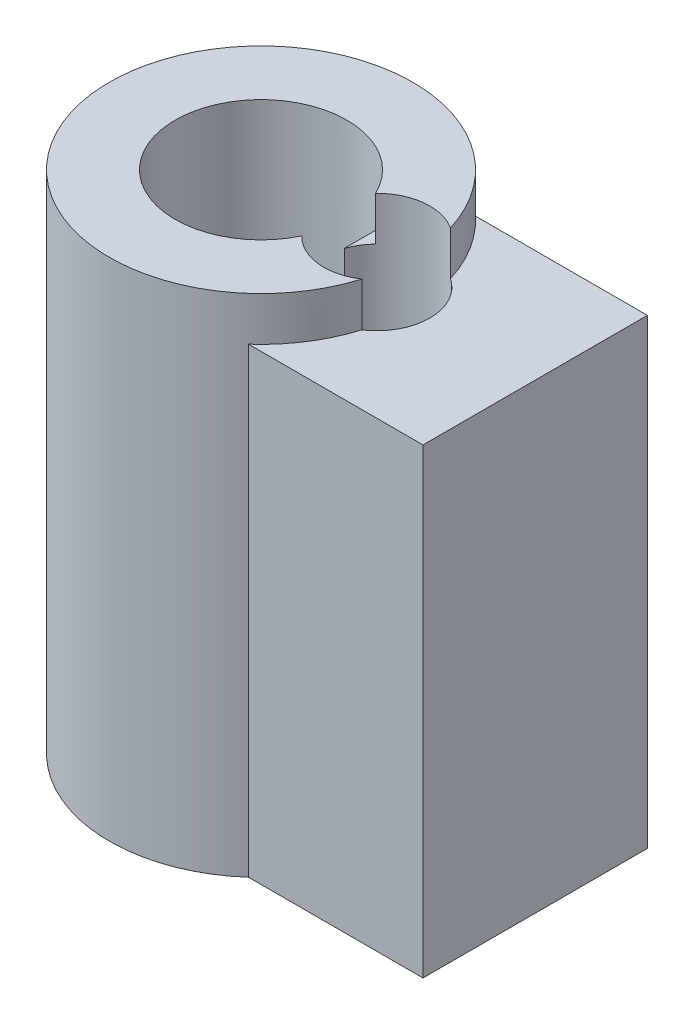
ISO-10303-21;
HEADER;
FILE_DESCRIPTION(('STEP AP214'),'2;1');
FILE_NAME('part.step','',(''),(''),'','','');
FILE_SCHEMA(('AUTOMOTIVE_DESIGN { 1 0 10303 214 1 1 1 1 }'));
ENDSEC;
DATA;
#1=APPLICATION_CONTEXT('core data for automotive mechanical design processes');
#2=APPLICATION_PROTOCOL_DEFINITION('international standard','automotive_design',2000,#1);
#3=PRODUCT_CONTEXT('',#1,'mechanical');
#4=PRODUCT('Part','Part','',(#3));
#5=PRODUCT_RELATED_PRODUCT_CATEGORY('part','',(#4));
#6=PRODUCT_DEFINITION_FORMATION('','',#4);
#7=PRODUCT_DEFINITION_CONTEXT('part definition',#1,'design');
#8=PRODUCT_DEFINITION('design','',#6,#7);
#9=PRODUCT_DEFINITION_SHAPE('','',#8);
#10=(LENGTH_UNIT() NAMED_UNIT(*) SI_UNIT(.MILLI.,.METRE.));
#11=(NAMED_UNIT(*) PLANE_ANGLE_UNIT() SI_UNIT($,.RADIAN.));
#12=(NAMED_UNIT(*) SI_UNIT($,.STERADIAN.) SOLID_ANGLE_UNIT());
#13=UNCERTAINTY_MEASURE_WITH_UNIT(LENGTH_MEASURE(1.E-05),#10,'distance_accuracy_value','');
#14=(GEOMETRIC_REPRESENTATION_CONTEXT(3) GLOBAL_UNCERTAINTY_ASSIGNED_CONTEXT((#13)) GLOBAL_UNIT_ASSIGNED_CONTEXT((#10,
#11,#12)) REPRESENTATION_CONTEXT('',''));
#15=CARTESIAN_POINT('',(0.,0.,0.));
#16=DIRECTION('',(0.,0.,1.));
#17=DIRECTION('',(1.,0.,0.));
#18=AXIS2_PLACEMENT_3D('',#15,#16,#17);
#19=CARTESIAN_POINT('',(0.,20.,0.));
#20=DIRECTION('',(0.,-1.,0.));
#21=DIRECTION('',(0.,0.,-1.));
#22=AXIS2_PLACEMENT_3D('',#19,#20,#21);
#23=CYLINDRICAL_SURFACE('',#22,6.);
#24=DIRECTION('',(0.,-1.,0.));
#25=VECTOR('',#24,1.);
#26=CARTESIAN_POINT('',(5.7385577507969,18.26,1.75184329800608));
#27=LINE('',#26,#25);
#28=CARTESIAN_POINT('',(5.7385577507969,20.,1.75184329800608));
#29=VERTEX_POINT('',#28);
#30=CARTESIAN_POINT('',(5.7385577507969,18.26,1.75184329800608));
#31=VERTEX_POINT('',#30);
#32=EDGE_CURVE('E46',#29,#31,#27,.T.);
#33=ORIENTED_EDGE('',*,*,#32,.F.);
#34=CARTESIAN_POINT('',(0.,20.,0.));
#35=DIRECTION('',(0.,1.,0.));
#36=DIRECTION('',(0.,0.,1.));
#37=AXIS2_PLACEMENT_3D('',#34,#35,#36);
#38=CIRCLE('',#37,6.);
#39=CARTESIAN_POINT('',(5.7385577507969,20.,-1.75184329800608));
#40=VERTEX_POINT('',#39);
#41=EDGE_CURVE('E129',#40,#29,#38,.T.);
#42=ORIENTED_EDGE('',*,*,#41,.F.);
#43=DIRECTION('',(0.,-1.,0.));
#44=VECTOR('',#43,1.);
#45=CARTESIAN_POINT('',(5.7385577507969,18.26,-1.75184329800608));
#46=LINE('',#45,#44);
#47=CARTESIAN_POINT('',(5.7385577507969,18.26,-1.75184329800608));
#48=VERTEX_POINT('',#47);
#49=EDGE_CURVE('E120',#48,#40,#46,.F.);
#50=ORIENTED_EDGE('',*,*,#49,.F.);
#51=CARTESIAN_POINT('',(0.,18.26,0.));
#52=DIRECTION('',(0.,-1.,0.));
#53=DIRECTION('',(0.,0.,-1.));
#54=AXIS2_PLACEMENT_3D('',#51,#52,#53);
#55=CIRCLE('',#54,6.);
#56=CARTESIAN_POINT('',(4.08541489606759,18.26,-4.39424454565163));
#57=VERTEX_POINT('',#56);
#58=EDGE_CURVE('E126',#57,#48,#55,.T.);
#59=ORIENTED_EDGE('',*,*,#58,.F.);
#60=DIRECTION('',(0.,-1.,0.));
#61=VECTOR('',#60,1.);
#62=CARTESIAN_POINT('',(4.08541489606759,20.,-4.39424454565163));
#63=LINE('',#62,#61);
#64=CARTESIAN_POINT('',(4.08541489606759,0.,-4.39424454565163));
#65=VERTEX_POINT('',#64);
#66=EDGE_CURVE('E138',#57,#65,#63,.T.);
#67=ORIENTED_EDGE('',*,*,#66,.T.);
#68=CARTESIAN_POINT('',(0.,0.,0.));
#69=DIRECTION('',(0.,1.,0.));
#70=DIRECTION('',(0.,0.,1.));
#71=AXIS2_PLACEMENT_3D('',#68,#69,#70);
#72=CIRCLE('',#71,6.);
#73=CARTESIAN_POINT('',(3.98914735179202,0.,4.48181920716251));
#74=VERTEX_POINT('',#73);
#75=EDGE_CURVE('E149',#65,#74,#72,.T.);
#76=ORIENTED_EDGE('',*,*,#75,.T.);
#77=DIRECTION('',(0.,-1.,0.));
#78=VECTOR('',#77,1.);
#79=CARTESIAN_POINT('',(3.98914735179202,20.,4.48181920716251));
#80=LINE('',#79,#78);
#81=CARTESIAN_POINT('',(3.98914735179202,18.26,4.48181920716251));
#82=VERTEX_POINT('',#81);
#83=EDGE_CURVE('E136',#74,#82,#80,.F.);
#84=ORIENTED_EDGE('',*,*,#83,.T.);
#85=EDGE_CURVE('E53',#31,#82,#55,.T.);
#86=ORIENTED_EDGE('',*,*,#85,.F.);
#87=EDGE_LOOP('',(#33,#42,#50,#59,#67,#76,#84,#86));
#88=FACE_BOUND('',#87,.T.);
#89=ADVANCED_FACE('F33',(#88),#23,.T.);
#90=CARTESIAN_POINT('',(0.,6.45,0.));
#91=DIRECTION('',(0.,1.,0.));
#92=DIRECTION('',(0.,0.,1.));
#93=AXIS2_PLACEMENT_3D('',#90,#91,#92);
#94=CYLINDRICAL_SURFACE('',#93,3.4);
#95=DIRECTION('',(0.,-1.,0.));
#96=VECTOR('',#95,1.);
#97=CARTESIAN_POINT('',(3.07073997921671,18.26,-1.45964241512782));
#98=LINE('',#97,#96);
#99=CARTESIAN_POINT('',(3.07073997921671,20.,-1.45964241512782));
#100=VERTEX_POINT('',#99);
#101=CARTESIAN_POINT('',(3.07073997921671,18.26,-1.45964241512782));
#102=VERTEX_POINT('',#101);
#103=EDGE_CURVE('E219',#100,#102,#98,.T.);
#104=ORIENTED_EDGE('',*,*,#103,.F.);
#105=CARTESIAN_POINT('',(0.,20.,0.));
#106=DIRECTION('',(0.,1.,0.));
#107=DIRECTION('',(0.,0.,1.));
#108=AXIS2_PLACEMENT_3D('',#105,#106,#107);
#109=CIRCLE('',#108,3.4);
#110=CARTESIAN_POINT('',(3.07073997921671,20.,1.45964241512782));
#111=VERTEX_POINT('',#110);
#112=EDGE_CURVE('E145',#100,#111,#109,.T.);
#113=ORIENTED_EDGE('',*,*,#112,.T.);
#114=DIRECTION('',(0.,-1.,0.));
#115=VECTOR('',#114,1.);
#116=CARTESIAN_POINT('',(3.07073997921671,18.26,1.45964241512782));
#117=LINE('',#116,#115);
#118=CARTESIAN_POINT('',(3.07073997921671,18.26,1.45964241512782));
#119=VERTEX_POINT('',#118);
#120=EDGE_CURVE('E221',#119,#111,#117,.F.);
#121=ORIENTED_EDGE('',*,*,#120,.F.);
#122=CARTESIAN_POINT('',(0.,18.26,0.));
#123=DIRECTION('',(0.,-1.,0.));
#124=DIRECTION('',(0.,0.,-1.));
#125=AXIS2_PLACEMENT_3D('',#122,#123,#124);
#126=CIRCLE('',#125,3.4);
#127=CARTESIAN_POINT('',(2.6,18.26,2.19089023002066));
#128=VERTEX_POINT('',#127);
#129=EDGE_CURVE('E40',#128,#119,#126,.F.);
#130=ORIENTED_EDGE('',*,*,#129,.F.);
#131=DIRECTION('',(0.,1.,0.));
#132=VECTOR('',#131,1.);
#133=CARTESIAN_POINT('',(2.6,6.45,2.19089023002066));
#134=LINE('',#133,#132);
#135=CARTESIAN_POINT('',(2.6,6.45,2.19089023002066));
#136=VERTEX_POINT('',#135);
#137=EDGE_CURVE('E140',#128,#136,#134,.F.);
#138=ORIENTED_EDGE('',*,*,#137,.T.);
#139=CARTESIAN_POINT('',(0.,6.45,0.));
#140=DIRECTION('',(0.,1.,0.));
#141=DIRECTION('',(0.,0.,1.));
#142=AXIS2_PLACEMENT_3D('',#139,#140,#141);
#143=CIRCLE('',#142,3.4);
#144=CARTESIAN_POINT('',(2.6,6.45,-2.19089023002066));
#145=VERTEX_POINT('',#144);
#146=EDGE_CURVE('E146',#145,#136,#143,.T.);
#147=ORIENTED_EDGE('',*,*,#146,.F.);
#148=DIRECTION('',(0.,1.,0.));
#149=VECTOR('',#148,1.);
#150=CARTESIAN_POINT('',(2.6,6.45,-2.19089023002066));
#151=LINE('',#150,#149);
#152=CARTESIAN_POINT('',(2.6,18.26,-2.19089023002066));
#153=VERTEX_POINT('',#152);
#154=EDGE_CURVE('E175',#145,#153,#151,.T.);
#155=ORIENTED_EDGE('',*,*,#154,.T.);
#156=EDGE_CURVE('E157',#102,#153,#126,.F.);
#157=ORIENTED_EDGE('',*,*,#156,.F.);
#158=EDGE_LOOP('',(#104,#113,#121,#130,#138,#147,#155,#157));
#159=FACE_BOUND('',#158,.T.);
#160=ADVANCED_FACE('F176',(#159),#94,.F.);
#161=CARTESIAN_POINT('',(2.6,-12.1438727434811,4.48181920716251));
#162=DIRECTION('',(-1.,0.,0.));
#163=DIRECTION('',(0.,0.,1.));
#164=AXIS2_PLACEMENT_3D('',#161,#162,#163);
#165=PLANE('',#164);
#166=DIRECTION('',(0.,0.,1.));
#167=VECTOR('',#166,1.);
#168=CARTESIAN_POINT('',(2.6,6.45,0.));
#169=LINE('',#168,#167);
#170=CARTESIAN_POINT('',(2.6,6.45,-0.698233220468591));
#171=VERTEX_POINT('',#170);
#172=EDGE_CURVE('E155',#145,#171,#169,.T.);
#173=ORIENTED_EDGE('',*,*,#172,.T.);
#174=DIRECTION('',(0.,-1.,0.));
#175=VECTOR('',#174,1.);
#176=CARTESIAN_POINT('',(2.6,48.26,-0.698233220468591));
#177=LINE('',#176,#175);
#178=CARTESIAN_POINT('',(2.6,18.26,-0.698233220468591));
#179=VERTEX_POINT('',#178);
#180=EDGE_CURVE('E182',#171,#179,#177,.F.);
#181=ORIENTED_EDGE('',*,*,#180,.T.);
#182=DIRECTION('',(0.,0.,1.));
#183=VECTOR('',#182,1.);
#184=CARTESIAN_POINT('',(2.6,18.26,4.48181920716251));
#185=LINE('',#184,#183);
#186=EDGE_CURVE('E169',#153,#179,#185,.T.);
#187=ORIENTED_EDGE('',*,*,#186,.F.);
#188=ORIENTED_EDGE('',*,*,#154,.F.);
#189=EDGE_LOOP('',(#173,#181,#187,#188));
#190=FACE_BOUND('',#189,.T.);
#191=ADVANCED_FACE('F181',(#190),#165,.T.);
#192=CARTESIAN_POINT('',(2.6,18.26,0.698233220468591));
#193=VERTEX_POINT('',#192);
#194=EDGE_CURVE('E184',#193,#128,#185,.T.);
#195=ORIENTED_EDGE('',*,*,#194,.F.);
#196=DIRECTION('',(0.,-1.,0.));
#197=VECTOR('',#196,1.);
#198=CARTESIAN_POINT('',(2.6,48.26,0.698233220468591));
#199=LINE('',#198,#197);
#200=CARTESIAN_POINT('',(2.6,6.45,0.698233220468591));
#201=VERTEX_POINT('',#200);
#202=EDGE_CURVE('E214',#193,#201,#199,.T.);
#203=ORIENTED_EDGE('',*,*,#202,.T.);
#204=EDGE_CURVE('E153',#201,#136,#169,.T.);
#205=ORIENTED_EDGE('',*,*,#204,.T.);
#206=ORIENTED_EDGE('',*,*,#137,.F.);
#207=EDGE_LOOP('',(#195,#203,#205,#206));
#208=FACE_BOUND('',#207,.T.);
#209=ADVANCED_FACE('F235',(#208),#165,.T.);
#210=CARTESIAN_POINT('',(0.,18.26,0.));
#211=DIRECTION('',(0.,-1.,0.));
#212=DIRECTION('',(0.,0.,-1.));
#213=AXIS2_PLACEMENT_3D('',#210,#211,#212);
#214=PLANE('',#213);
#215=CARTESIAN_POINT('',(4.58052275165777,18.26,0.));
#216=DIRECTION('',(0.,-1.,0.));
#217=DIRECTION('',(0.,0.,-1.));
#218=AXIS2_PLACEMENT_3D('',#215,#216,#217);
#219=CIRCLE('',#218,2.1);
#220=EDGE_CURVE('E170',#102,#179,#219,.F.);
#221=ORIENTED_EDGE('',*,*,#220,.F.);
#222=ORIENTED_EDGE('',*,*,#156,.T.);
#223=ORIENTED_EDGE('',*,*,#186,.T.);
#224=EDGE_LOOP('',(#221,#222,#223));
#225=FACE_BOUND('',#224,.T.);
#226=ADVANCED_FACE('F167',(#225),#214,.F.);
#227=CARTESIAN_POINT('',(0.,20.,0.));
#228=DIRECTION('',(0.,1.,0.));
#229=DIRECTION('',(0.,0.,1.));
#230=AXIS2_PLACEMENT_3D('',#227,#228,#229);
#231=PLANE('',#230);
#232=ORIENTED_EDGE('',*,*,#112,.F.);
#233=CARTESIAN_POINT('',(4.58052275165777,20.,0.));
#234=DIRECTION('',(0.,1.,0.));
#235=DIRECTION('',(0.,0.,1.));
#236=AXIS2_PLACEMENT_3D('',#233,#234,#235);
#237=CIRCLE('',#236,2.1);
#238=EDGE_CURVE('E223',#100,#40,#237,.F.);
#239=ORIENTED_EDGE('',*,*,#238,.T.);
#240=ORIENTED_EDGE('',*,*,#41,.T.);
#241=EDGE_CURVE('E224',#29,#111,#237,.F.);
#242=ORIENTED_EDGE('',*,*,#241,.T.);
#243=EDGE_LOOP('',(#232,#239,#240,#242));
#244=FACE_BOUND('',#243,.T.);
#245=ADVANCED_FACE('F229',(#244),#231,.T.);
#246=CARTESIAN_POINT('',(0.,0.,0.));
#247=DIRECTION('',(0.,1.,0.));
#248=DIRECTION('',(0.,0.,1.));
#249=AXIS2_PLACEMENT_3D('',#246,#247,#248);
#250=PLANE('',#249);
#251=CARTESIAN_POINT('',(4.58052275165777,0.,0.));
#252=DIRECTION('',(0.,1.,0.));
#253=DIRECTION('',(0.,0.,1.));
#254=AXIS2_PLACEMENT_3D('',#251,#252,#253);
#255=CIRCLE('',#254,2.1);
#256=CARTESIAN_POINT('',(4.58052275165777,0.,2.1));
#257=VERTEX_POINT('',#256);
#258=EDGE_CURVE('E188',#257,#257,#255,.F.);
#259=ORIENTED_EDGE('',*,*,#258,.F.);
#260=EDGE_LOOP('',(#259));
#261=FACE_BOUND('',#260,.T.);
#262=ORIENTED_EDGE('',*,*,#75,.F.);
#263=DIRECTION('',(1.,0.,0.));
#264=VECTOR('',#263,1.);
#265=CARTESIAN_POINT('',(2.6,0.,-4.39424454565163));
#266=LINE('',#265,#264);
#267=CARTESIAN_POINT('',(10.8878910143559,0.,-4.39424454565163));
#268=VERTEX_POINT('',#267);
#269=EDGE_CURVE('E190',#65,#268,#266,.T.);
#270=ORIENTED_EDGE('',*,*,#269,.T.);
#271=DIRECTION('',(0.,0.,1.));
#272=VECTOR('',#271,1.);
#273=CARTESIAN_POINT('',(10.8878910143559,0.,4.48181920716251));
#274=LINE('',#273,#272);
#275=CARTESIAN_POINT('',(10.8878910143559,0.,4.48181920716251));
#276=VERTEX_POINT('',#275);
#277=EDGE_CURVE('E198',#268,#276,#274,.T.);
#278=ORIENTED_EDGE('',*,*,#277,.T.);
#279=DIRECTION('',(-1.,0.,0.));
#280=VECTOR('',#279,1.);
#281=CARTESIAN_POINT('',(2.6,0.,4.48181920716251));
#282=LINE('',#281,#280);
#283=EDGE_CURVE('E179',#276,#74,#282,.T.);
#284=ORIENTED_EDGE('',*,*,#283,.T.);
#285=EDGE_LOOP('',(#262,#270,#278,#284));
#286=FACE_BOUND('',#285,.T.);
#287=ADVANCED_FACE('F240',(#261,#286),#250,.F.);
#288=CARTESIAN_POINT('',(0.,6.45,0.));
#289=DIRECTION('',(0.,1.,0.));
#290=DIRECTION('',(0.,0.,1.));
#291=AXIS2_PLACEMENT_3D('',#288,#289,#290);
#292=PLANE('',#291);
#293=ORIENTED_EDGE('',*,*,#204,.F.);
#294=CARTESIAN_POINT('',(4.58052275165777,6.45,0.));
#295=DIRECTION('',(0.,1.,0.));
#296=DIRECTION('',(0.,0.,1.));
#297=AXIS2_PLACEMENT_3D('',#294,#295,#296);
#298=CIRCLE('',#297,2.1);
#299=EDGE_CURVE('E210',#201,#171,#298,.F.);
#300=ORIENTED_EDGE('',*,*,#299,.T.);
#301=ORIENTED_EDGE('',*,*,#172,.F.);
#302=ORIENTED_EDGE('',*,*,#146,.T.);
#303=EDGE_LOOP('',(#293,#300,#301,#302));
#304=FACE_BOUND('',#303,.T.);
#305=ADVANCED_FACE('F238',(#304),#292,.T.);
#306=EDGE_CURVE('E217',#193,#119,#219,.F.);
#307=ORIENTED_EDGE('',*,*,#306,.F.);
#308=ORIENTED_EDGE('',*,*,#194,.T.);
#309=ORIENTED_EDGE('',*,*,#129,.T.);
#310=EDGE_LOOP('',(#307,#308,#309));
#311=FACE_BOUND('',#310,.T.);
#312=ADVANCED_FACE('F233',(#311),#214,.F.);
#313=CARTESIAN_POINT('',(2.6,-12.1438727434811,-4.39424454565163));
#314=DIRECTION('',(0.,0.,-1.));
#315=DIRECTION('',(-1.,0.,0.));
#316=AXIS2_PLACEMENT_3D('',#313,#314,#315);
#317=PLANE('',#316);
#318=ORIENTED_EDGE('',*,*,#66,.F.);
#319=DIRECTION('',(-1.,0.,0.));
#320=VECTOR('',#319,1.);
#321=CARTESIAN_POINT('',(2.6,18.26,-4.39424454565163));
#322=LINE('',#321,#320);
#323=CARTESIAN_POINT('',(10.8878910143559,18.26,-4.39424454565163));
#324=VERTEX_POINT('',#323);
#325=EDGE_CURVE('E135',#324,#57,#322,.T.);
#326=ORIENTED_EDGE('',*,*,#325,.F.);
#327=DIRECTION('',(0.,1.,0.));
#328=VECTOR('',#327,1.);
#329=CARTESIAN_POINT('',(10.8878910143559,-12.1438727434811,-4.39424454565163));
#330=LINE('',#329,#328);
#331=EDGE_CURVE('E196',#268,#324,#330,.T.);
#332=ORIENTED_EDGE('',*,*,#331,.F.);
#333=ORIENTED_EDGE('',*,*,#269,.F.);
#334=EDGE_LOOP('',(#318,#326,#332,#333));
#335=FACE_BOUND('',#334,.T.);
#336=ADVANCED_FACE('F246',(#335),#317,.T.);
#337=CARTESIAN_POINT('',(2.6,-12.1438727434811,4.48181920716251));
#338=DIRECTION('',(0.,0.,1.));
#339=DIRECTION('',(1.,0.,0.));
#340=AXIS2_PLACEMENT_3D('',#337,#338,#339);
#341=PLANE('',#340);
#342=ORIENTED_EDGE('',*,*,#83,.F.);
#343=ORIENTED_EDGE('',*,*,#283,.F.);
#344=DIRECTION('',(0.,1.,0.));
#345=VECTOR('',#344,1.);
#346=CARTESIAN_POINT('',(10.8878910143559,-12.1438727434811,4.48181920716251));
#347=LINE('',#346,#345);
#348=CARTESIAN_POINT('',(10.8878910143559,18.26,4.48181920716251));
#349=VERTEX_POINT('',#348);
#350=EDGE_CURVE('E195',#276,#349,#347,.T.);
#351=ORIENTED_EDGE('',*,*,#350,.T.);
#352=DIRECTION('',(1.,0.,0.));
#353=VECTOR('',#352,1.);
#354=CARTESIAN_POINT('',(2.6,18.26,4.48181920716251));
#355=LINE('',#354,#353);
#356=EDGE_CURVE('E183',#82,#349,#355,.T.);
#357=ORIENTED_EDGE('',*,*,#356,.F.);
#358=EDGE_LOOP('',(#342,#343,#351,#357));
#359=FACE_BOUND('',#358,.T.);
#360=ADVANCED_FACE('F270',(#359),#341,.T.);
#361=CARTESIAN_POINT('',(4.58052275165777,18.26,0.));
#362=DIRECTION('',(0.,-1.,0.));
#363=DIRECTION('',(0.,0.,-1.));
#364=AXIS2_PLACEMENT_3D('',#361,#362,#363);
#365=CIRCLE('',#364,2.1);
#366=EDGE_CURVE('E11',#31,#48,#365,.F.);
#367=ORIENTED_EDGE('',*,*,#366,.F.);
#368=ORIENTED_EDGE('',*,*,#85,.T.);
#369=ORIENTED_EDGE('',*,*,#356,.T.);
#370=DIRECTION('',(0.,0.,-1.));
#371=VECTOR('',#370,1.);
#372=CARTESIAN_POINT('',(10.8878910143559,18.26,4.48181920716251));
#373=LINE('',#372,#371);
#374=EDGE_CURVE('E186',#349,#324,#373,.T.);
#375=ORIENTED_EDGE('',*,*,#374,.T.);
#376=ORIENTED_EDGE('',*,*,#325,.T.);
#377=ORIENTED_EDGE('',*,*,#58,.T.);
#378=EDGE_LOOP('',(#367,#368,#369,#375,#376,#377));
#379=FACE_BOUND('',#378,.T.);
#380=ADVANCED_FACE('F132',(#379),#214,.F.);
#381=CARTESIAN_POINT('',(10.8878910143559,-12.1438727434811,4.48181920716251));
#382=DIRECTION('',(1.,0.,0.));
#383=DIRECTION('',(0.,0.,-1.));
#384=AXIS2_PLACEMENT_3D('',#381,#382,#383);
#385=PLANE('',#384);
#386=ORIENTED_EDGE('',*,*,#277,.F.);
#387=ORIENTED_EDGE('',*,*,#331,.T.);
#388=ORIENTED_EDGE('',*,*,#374,.F.);
#389=ORIENTED_EDGE('',*,*,#350,.F.);
#390=EDGE_LOOP('',(#386,#387,#388,#389));
#391=FACE_BOUND('',#390,.T.);
#392=ADVANCED_FACE('F269',(#391),#385,.T.);
#393=CARTESIAN_POINT('',(4.58052275165777,48.26,0.));
#394=DIRECTION('',(0.,-1.,0.));
#395=DIRECTION('',(0.,0.,-1.));
#396=AXIS2_PLACEMENT_3D('',#393,#394,#395);
#397=CYLINDRICAL_SURFACE('',#396,2.1);
#398=ORIENTED_EDGE('',*,*,#202,.F.);
#399=ORIENTED_EDGE('',*,*,#306,.T.);
#400=ORIENTED_EDGE('',*,*,#120,.T.);
#401=ORIENTED_EDGE('',*,*,#241,.F.);
#402=ORIENTED_EDGE('',*,*,#32,.T.);
#403=ORIENTED_EDGE('',*,*,#366,.T.);
#404=ORIENTED_EDGE('',*,*,#49,.T.);
#405=ORIENTED_EDGE('',*,*,#238,.F.);
#406=ORIENTED_EDGE('',*,*,#103,.T.);
#407=ORIENTED_EDGE('',*,*,#220,.T.);
#408=ORIENTED_EDGE('',*,*,#180,.F.);
#409=ORIENTED_EDGE('',*,*,#299,.F.);
#410=EDGE_LOOP('',(#398,#399,#400,#401,#402,#403,#404,#405,#406,#407,#408,#409));
#411=FACE_BOUND('',#410,.T.);
#412=ORIENTED_EDGE('',*,*,#258,.T.);
#413=EDGE_LOOP('',(#412));
#414=FACE_BOUND('',#413,.T.);
#415=ADVANCED_FACE('F118',(#411,#414),#397,.F.);
#416=CLOSED_SHELL('',(#89,#160,#191,#209,#226,#245,#287,#305,#312,#336,#360,#380,#392,#415));
#417=MANIFOLD_SOLID_BREP('B2',#416);
#418=ADVANCED_BREP_SHAPE_REPRESENTATION('',(#18,#417),#14);
#419=SHAPE_DEFINITION_REPRESENTATION(#9,#418);
ENDSEC;
END-ISO-10303-21;
